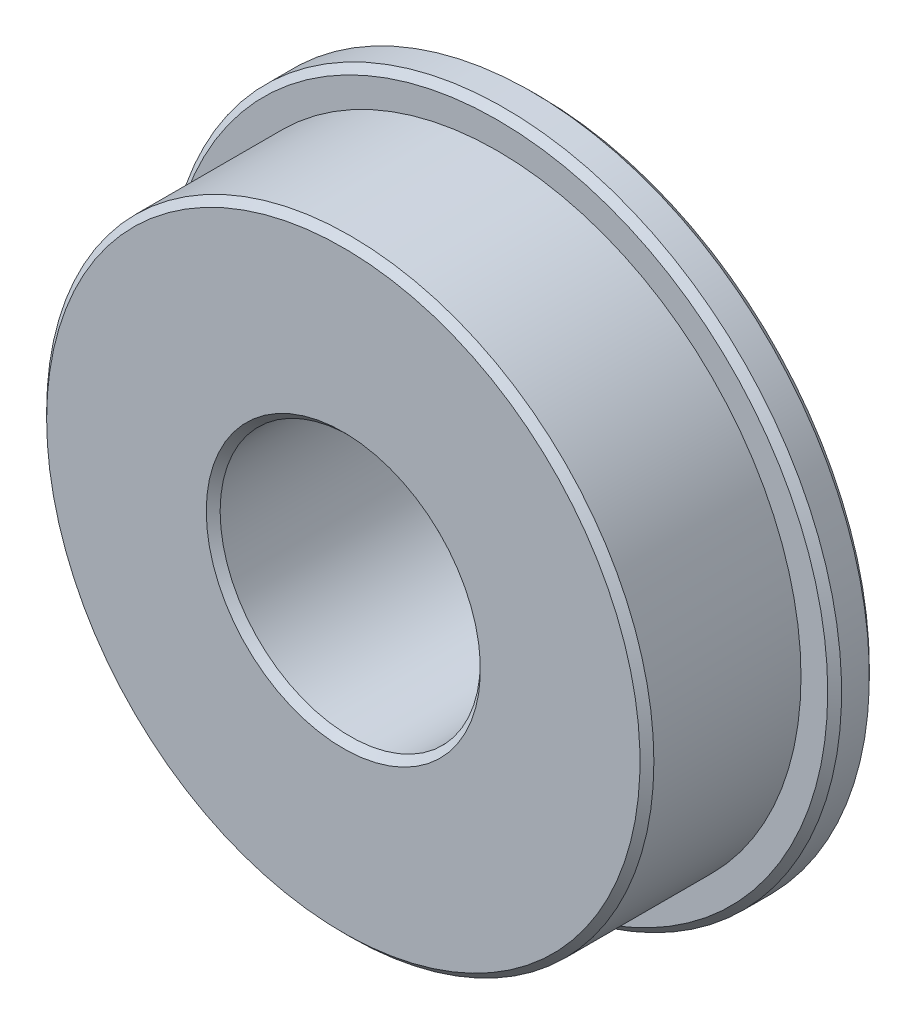
ISO-10303-21;
HEADER;
FILE_DESCRIPTION(('STEP AP214'),'2;1');
FILE_NAME('part.step','',(''),(''),'','','');
FILE_SCHEMA(('AUTOMOTIVE_DESIGN { 1 0 10303 214 1 1 1 1 }'));
ENDSEC;
DATA;
#1=APPLICATION_CONTEXT('core data for automotive mechanical design processes');
#2=APPLICATION_PROTOCOL_DEFINITION('international standard','automotive_design',2000,#1);
#3=PRODUCT_CONTEXT('',#1,'mechanical');
#4=PRODUCT('Part','Part','',(#3));
#5=PRODUCT_RELATED_PRODUCT_CATEGORY('part','',(#4));
#6=PRODUCT_DEFINITION_FORMATION('','',#4);
#7=PRODUCT_DEFINITION_CONTEXT('part definition',#1,'design');
#8=PRODUCT_DEFINITION('design','',#6,#7);
#9=PRODUCT_DEFINITION_SHAPE('','',#8);
#10=(LENGTH_UNIT() NAMED_UNIT(*) SI_UNIT(.MILLI.,.METRE.));
#11=(NAMED_UNIT(*) PLANE_ANGLE_UNIT() SI_UNIT($,.RADIAN.));
#12=(NAMED_UNIT(*) SI_UNIT($,.STERADIAN.) SOLID_ANGLE_UNIT());
#13=UNCERTAINTY_MEASURE_WITH_UNIT(LENGTH_MEASURE(1.E-05),#10,'distance_accuracy_value','');
#14=(GEOMETRIC_REPRESENTATION_CONTEXT(3) GLOBAL_UNCERTAINTY_ASSIGNED_CONTEXT((#13)) GLOBAL_UNIT_ASSIGNED_CONTEXT((#10,
#11,#12)) REPRESENTATION_CONTEXT('',''));
#15=CARTESIAN_POINT('',(0.,0.,0.));
#16=DIRECTION('',(0.,0.,1.));
#17=DIRECTION('',(1.,0.,0.));
#18=AXIS2_PLACEMENT_3D('',#15,#16,#17);
#19=CARTESIAN_POINT('',(-8.86153846153845,6.04195804195806,1.52399999999997));
#20=DIRECTION('',(0.,0.,1.));
#21=DIRECTION('',(-1.,0.,0.));
#22=AXIS2_PLACEMENT_3D('',#19,#20,#21);
#23=CYLINDRICAL_SURFACE('',#22,4.7625);
#24=CARTESIAN_POINT('',(-8.86153846153845,6.04195804195806,0.253999999999976));
#25=DIRECTION('',(0.,0.,-1.));
#26=DIRECTION('',(-1.,0.,0.));
#27=AXIS2_PLACEMENT_3D('',#24,#25,#26);
#28=CIRCLE('',#27,4.7625);
#29=CARTESIAN_POINT('',(-13.6240384615385,6.04195804195805,0.253999999999976));
#30=VERTEX_POINT('',#29);
#31=EDGE_CURVE('E9',#30,#30,#28,.T.);
#32=ORIENTED_EDGE('',*,*,#31,.T.);
#33=EDGE_LOOP('',(#32));
#34=FACE_BOUND('',#33,.T.);
#35=CARTESIAN_POINT('',(-8.86153846153845,6.04195804195806,6.90880000000005));
#36=DIRECTION('',(0.,0.,1.));
#37=DIRECTION('',(-1.,0.,0.));
#38=AXIS2_PLACEMENT_3D('',#35,#36,#37);
#39=CIRCLE('',#38,4.7625);
#40=CARTESIAN_POINT('',(-13.6240384615385,6.04195804195805,6.90880000000005));
#41=VERTEX_POINT('',#40);
#42=EDGE_CURVE('E26',#41,#41,#39,.T.);
#43=ORIENTED_EDGE('',*,*,#42,.T.);
#44=EDGE_LOOP('',(#43));
#45=FACE_BOUND('',#44,.T.);
#46=ADVANCED_FACE('F15',(#34,#45),#23,.F.);
#47=CARTESIAN_POINT('',(-8.86153846153845,6.04195804195806,1.52399999999997));
#48=DIRECTION('',(0.,0.,1.));
#49=DIRECTION('',(-1.,0.,0.));
#50=AXIS2_PLACEMENT_3D('',#47,#48,#49);
#51=CYLINDRICAL_SURFACE('',#50,12.3444);
#52=CARTESIAN_POINT('',(-8.86153846153845,6.04195804195806,0.253999999999976));
#53=DIRECTION('',(0.,0.,1.));
#54=DIRECTION('',(-1.,0.,0.));
#55=AXIS2_PLACEMENT_3D('',#52,#53,#54);
#56=CIRCLE('',#55,12.3444);
#57=CARTESIAN_POINT('',(-21.2059384615385,6.04195804195804,0.253999999999976));
#58=VERTEX_POINT('',#57);
#59=EDGE_CURVE('E87',#58,#58,#56,.T.);
#60=ORIENTED_EDGE('',*,*,#59,.T.);
#61=EDGE_LOOP('',(#60));
#62=FACE_BOUND('',#61,.T.);
#63=CARTESIAN_POINT('',(-8.86153846153845,6.04195804195806,1.26999999999999));
#64=DIRECTION('',(0.,0.,-1.));
#65=DIRECTION('',(-1.,0.,0.));
#66=AXIS2_PLACEMENT_3D('',#63,#64,#65);
#67=CIRCLE('',#66,12.3444);
#68=CARTESIAN_POINT('',(-21.2059384615385,6.04195804195804,1.26999999999999));
#69=VERTEX_POINT('',#68);
#70=EDGE_CURVE('E92',#69,#69,#67,.T.);
#71=ORIENTED_EDGE('',*,*,#70,.T.);
#72=EDGE_LOOP('',(#71));
#73=FACE_BOUND('',#72,.T.);
#74=ADVANCED_FACE('F144',(#62,#73),#51,.T.);
#75=CARTESIAN_POINT('',(-8.86153846153845,6.04195804195806,1.52399999999997));
#76=DIRECTION('',(0.,0.,-1.));
#77=DIRECTION('',(0.,-1.,0.));
#78=AXIS2_PLACEMENT_3D('',#75,#76,#77);
#79=PLANE('',#78);
#80=CARTESIAN_POINT('',(-8.86153846153845,6.04195804195806,1.52399999999997));
#81=DIRECTION('',(0.,0.,1.));
#82=DIRECTION('',(-1.,0.,0.));
#83=AXIS2_PLACEMENT_3D('',#80,#81,#82);
#84=CIRCLE('',#83,12.0904);
#85=CARTESIAN_POINT('',(-20.9519384615385,6.04195804195803,1.52399999999997));
#86=VERTEX_POINT('',#85);
#87=EDGE_CURVE('E19',#86,#86,#84,.T.);
#88=ORIENTED_EDGE('',*,*,#87,.T.);
#89=EDGE_LOOP('',(#88));
#90=FACE_BOUND('',#89,.T.);
#91=CARTESIAN_POINT('',(-8.86153846153845,6.04195804195806,1.52399999999997));
#92=DIRECTION('',(0.,0.,-1.));
#93=DIRECTION('',(0.,1.,0.));
#94=AXIS2_PLACEMENT_3D('',#91,#92,#93);
#95=CIRCLE('',#94,11.1125);
#96=CARTESIAN_POINT('',(-8.86153846153846,17.154458041958,1.52399999999997));
#97=VERTEX_POINT('',#96);
#98=EDGE_CURVE('E66',#97,#97,#95,.T.);
#99=ORIENTED_EDGE('',*,*,#98,.T.);
#100=EDGE_LOOP('',(#99));
#101=FACE_BOUND('',#100,.T.);
#102=ADVANCED_FACE('F149',(#90,#101),#79,.F.);
#103=CARTESIAN_POINT('',(-8.86153846153845,6.04195804195806,7.16280000000002));
#104=DIRECTION('',(0.,0.,1.));
#105=DIRECTION('',(-1.,0.,0.));
#106=AXIS2_PLACEMENT_3D('',#103,#104,#105);
#107=CYLINDRICAL_SURFACE('',#106,11.1125);
#108=CARTESIAN_POINT('',(-8.86153846153845,6.04195804195806,6.90880000000005));
#109=DIRECTION('',(0.,0.,-1.));
#110=DIRECTION('',(-1.,0.,0.));
#111=AXIS2_PLACEMENT_3D('',#108,#109,#110);
#112=CIRCLE('',#111,11.1125);
#113=CARTESIAN_POINT('',(-19.9740384615385,6.04195804195805,6.90880000000005));
#114=VERTEX_POINT('',#113);
#115=EDGE_CURVE('E76',#114,#114,#112,.T.);
#116=ORIENTED_EDGE('',*,*,#115,.T.);
#117=EDGE_LOOP('',(#116));
#118=FACE_BOUND('',#117,.T.);
#119=ORIENTED_EDGE('',*,*,#98,.F.);
#120=EDGE_LOOP('',(#119));
#121=FACE_BOUND('',#120,.T.);
#122=ADVANCED_FACE('F153',(#118,#121),#107,.T.);
#123=CARTESIAN_POINT('',(-8.86153846153845,6.04195804195806,7.16280000000002));
#124=DIRECTION('',(0.,0.,-1.));
#125=DIRECTION('',(0.,-1.,0.));
#126=AXIS2_PLACEMENT_3D('',#123,#124,#125);
#127=PLANE('',#126);
#128=CARTESIAN_POINT('',(-8.86153846153845,6.04195804195806,7.16280000000002));
#129=DIRECTION('',(0.,0.,-1.));
#130=DIRECTION('',(-1.,0.,0.));
#131=AXIS2_PLACEMENT_3D('',#128,#129,#130);
#132=CIRCLE('',#131,5.0165);
#133=CARTESIAN_POINT('',(-13.8780384615385,6.04195804195805,7.16280000000002));
#134=VERTEX_POINT('',#133);
#135=EDGE_CURVE('E110',#134,#134,#132,.T.);
#136=ORIENTED_EDGE('',*,*,#135,.T.);
#137=EDGE_LOOP('',(#136));
#138=FACE_BOUND('',#137,.T.);
#139=CARTESIAN_POINT('',(-8.86153846153845,6.04195804195806,7.16280000000002));
#140=DIRECTION('',(0.,0.,1.));
#141=DIRECTION('',(-1.,0.,0.));
#142=AXIS2_PLACEMENT_3D('',#139,#140,#141);
#143=CIRCLE('',#142,10.8585);
#144=CARTESIAN_POINT('',(-19.7200384615385,6.04195804195804,7.16280000000002));
#145=VERTEX_POINT('',#144);
#146=EDGE_CURVE('E108',#145,#145,#143,.T.);
#147=ORIENTED_EDGE('',*,*,#146,.T.);
#148=EDGE_LOOP('',(#147));
#149=FACE_BOUND('',#148,.T.);
#150=ADVANCED_FACE('F156',(#138,#149),#127,.F.);
#151=CARTESIAN_POINT('',(-8.86153846153845,6.04195804195806,0.));
#152=DIRECTION('',(0.,0.,-1.));
#153=DIRECTION('',(0.,-1.,0.));
#154=AXIS2_PLACEMENT_3D('',#151,#152,#153);
#155=PLANE('',#154);
#156=CARTESIAN_POINT('',(-8.86153846153845,6.04195804195806,0.));
#157=DIRECTION('',(0.,0.,1.));
#158=DIRECTION('',(-1.,0.,0.));
#159=AXIS2_PLACEMENT_3D('',#156,#157,#158);
#160=CIRCLE('',#159,5.0165);
#161=CARTESIAN_POINT('',(-13.8780384615385,6.04195804195805,0.));
#162=VERTEX_POINT('',#161);
#163=EDGE_CURVE('E105',#162,#162,#160,.T.);
#164=ORIENTED_EDGE('',*,*,#163,.T.);
#165=EDGE_LOOP('',(#164));
#166=FACE_BOUND('',#165,.T.);
#167=CARTESIAN_POINT('',(-8.86153846153845,6.04195804195806,0.));
#168=DIRECTION('',(0.,0.,-1.));
#169=DIRECTION('',(-1.,0.,0.));
#170=AXIS2_PLACEMENT_3D('',#167,#168,#169);
#171=CIRCLE('',#170,12.0904);
#172=CARTESIAN_POINT('',(-20.9519384615385,6.04195804195803,0.));
#173=VERTEX_POINT('',#172);
#174=EDGE_CURVE('E109',#173,#173,#171,.T.);
#175=ORIENTED_EDGE('',*,*,#174,.T.);
#176=EDGE_LOOP('',(#175));
#177=FACE_BOUND('',#176,.T.);
#178=ADVANCED_FACE('F128',(#166,#177),#155,.T.);
#179=CARTESIAN_POINT('',(-8.86153846153845,6.04195804195806,0.253999999999976));
#180=DIRECTION('',(0.,0.,-1.));
#181=DIRECTION('',(-1.,0.,0.));
#182=AXIS2_PLACEMENT_3D('',#179,#180,#181);
#183=CONICAL_SURFACE('',#182,4.7625,0.78539816339745);
#184=ORIENTED_EDGE('',*,*,#163,.F.);
#185=EDGE_LOOP('',(#184));
#186=FACE_BOUND('',#185,.T.);
#187=ORIENTED_EDGE('',*,*,#31,.F.);
#188=EDGE_LOOP('',(#187));
#189=FACE_BOUND('',#188,.T.);
#190=ADVANCED_FACE('F138',(#186,#189),#183,.F.);
#191=CARTESIAN_POINT('',(-8.86153846153845,6.04195804195806,7.16280000000002));
#192=DIRECTION('',(0.,0.,1.));
#193=DIRECTION('',(1.,0.,0.));
#194=AXIS2_PLACEMENT_3D('',#191,#192,#193);
#195=CONICAL_SURFACE('',#194,5.0165,0.785398163397448);
#196=ORIENTED_EDGE('',*,*,#42,.F.);
#197=EDGE_LOOP('',(#196));
#198=FACE_BOUND('',#197,.T.);
#199=ORIENTED_EDGE('',*,*,#135,.F.);
#200=EDGE_LOOP('',(#199));
#201=FACE_BOUND('',#200,.T.);
#202=ADVANCED_FACE('F130',(#198,#201),#195,.F.);
#203=CARTESIAN_POINT('',(-8.86153846153845,6.04195804195806,0.));
#204=DIRECTION('',(0.,0.,1.));
#205=DIRECTION('',(1.,0.,0.));
#206=AXIS2_PLACEMENT_3D('',#203,#204,#205);
#207=CONICAL_SURFACE('',#206,12.0904,0.78539816339745);
#208=ORIENTED_EDGE('',*,*,#59,.F.);
#209=EDGE_LOOP('',(#208));
#210=FACE_BOUND('',#209,.T.);
#211=ORIENTED_EDGE('',*,*,#174,.F.);
#212=EDGE_LOOP('',(#211));
#213=FACE_BOUND('',#212,.T.);
#214=ADVANCED_FACE('F88',(#210,#213),#207,.T.);
#215=CARTESIAN_POINT('',(-8.86153846153845,6.04195804195806,1.26999999999999));
#216=DIRECTION('',(0.,0.,-1.));
#217=DIRECTION('',(-1.,0.,0.));
#218=AXIS2_PLACEMENT_3D('',#215,#216,#217);
#219=CONICAL_SURFACE('',#218,12.3444,0.78539816339745);
#220=ORIENTED_EDGE('',*,*,#87,.F.);
#221=EDGE_LOOP('',(#220));
#222=FACE_BOUND('',#221,.T.);
#223=ORIENTED_EDGE('',*,*,#70,.F.);
#224=EDGE_LOOP('',(#223));
#225=FACE_BOUND('',#224,.T.);
#226=ADVANCED_FACE('F17',(#222,#225),#219,.T.);
#227=CARTESIAN_POINT('',(-8.86153846153845,6.04195804195806,6.90880000000005));
#228=DIRECTION('',(0.,0.,-1.));
#229=DIRECTION('',(-1.,0.,0.));
#230=AXIS2_PLACEMENT_3D('',#227,#228,#229);
#231=CONICAL_SURFACE('',#230,11.1125,0.78539816339745);
#232=ORIENTED_EDGE('',*,*,#146,.F.);
#233=EDGE_LOOP('',(#232));
#234=FACE_BOUND('',#233,.T.);
#235=ORIENTED_EDGE('',*,*,#115,.F.);
#236=EDGE_LOOP('',(#235));
#237=FACE_BOUND('',#236,.T.);
#238=ADVANCED_FACE('F137',(#234,#237),#231,.T.);
#239=CLOSED_SHELL('',(#46,#74,#102,#122,#150,#178,#190,#202,#214,#226,#238));
#240=MANIFOLD_SOLID_BREP('B1',#239);
#241=ADVANCED_BREP_SHAPE_REPRESENTATION('',(#18,#240),#14);
#242=SHAPE_DEFINITION_REPRESENTATION(#9,#241);
ENDSEC;
END-ISO-10303-21;
